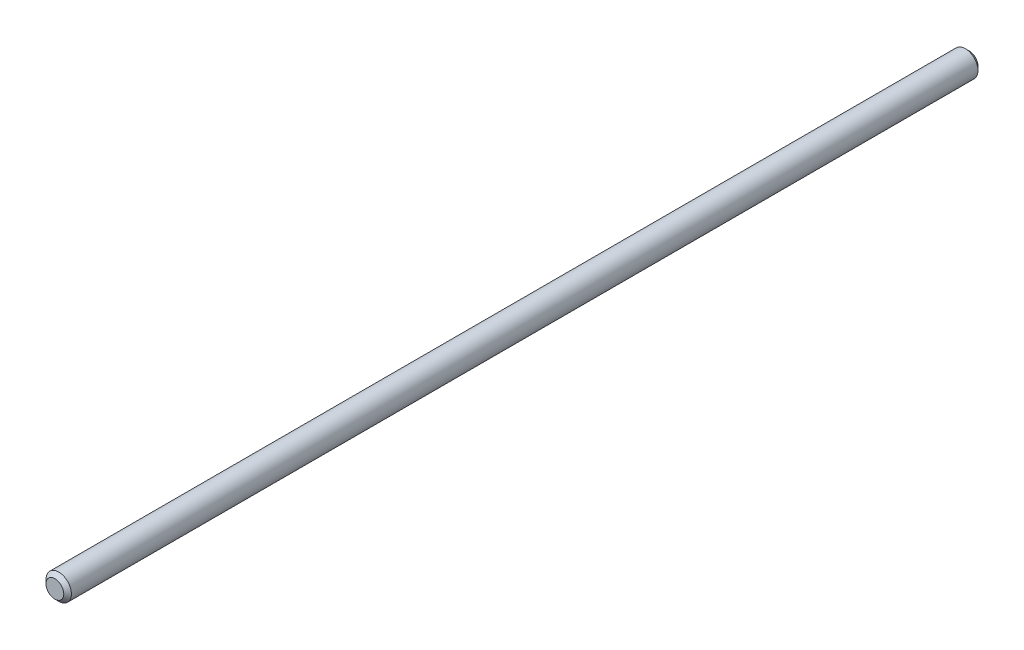
ISO-10303-21;
HEADER;
FILE_DESCRIPTION(('STEP AP214'),'2;1');
FILE_NAME('part.step','',(''),(''),'','','');
FILE_SCHEMA(('AUTOMOTIVE_DESIGN { 1 0 10303 214 1 1 1 1 }'));
ENDSEC;
DATA;
#1=APPLICATION_CONTEXT('core data for automotive mechanical design processes');
#2=APPLICATION_PROTOCOL_DEFINITION('international standard','automotive_design',2000,#1);
#3=PRODUCT_CONTEXT('',#1,'mechanical');
#4=PRODUCT('Part','Part','',(#3));
#5=PRODUCT_RELATED_PRODUCT_CATEGORY('part','',(#4));
#6=PRODUCT_DEFINITION_FORMATION('','',#4);
#7=PRODUCT_DEFINITION_CONTEXT('part definition',#1,'design');
#8=PRODUCT_DEFINITION('design','',#6,#7);
#9=PRODUCT_DEFINITION_SHAPE('','',#8);
#10=(LENGTH_UNIT() NAMED_UNIT(*) SI_UNIT(.MILLI.,.METRE.));
#11=(NAMED_UNIT(*) PLANE_ANGLE_UNIT() SI_UNIT($,.RADIAN.));
#12=(NAMED_UNIT(*) SI_UNIT($,.STERADIAN.) SOLID_ANGLE_UNIT());
#13=UNCERTAINTY_MEASURE_WITH_UNIT(LENGTH_MEASURE(1.E-05),#10,'distance_accuracy_value','');
#14=(GEOMETRIC_REPRESENTATION_CONTEXT(3) GLOBAL_UNCERTAINTY_ASSIGNED_CONTEXT((#13)) GLOBAL_UNIT_ASSIGNED_CONTEXT((#10,
#11,#12)) REPRESENTATION_CONTEXT('',''));
#15=CARTESIAN_POINT('',(0.,0.,0.));
#16=DIRECTION('',(0.,0.,1.));
#17=DIRECTION('',(1.,0.,0.));
#18=AXIS2_PLACEMENT_3D('',#15,#16,#17);
#19=CARTESIAN_POINT('',(0.,0.,114.3));
#20=DIRECTION('',(0.,0.,1.));
#21=DIRECTION('',(1.,0.,0.));
#22=AXIS2_PLACEMENT_3D('',#19,#20,#21);
#23=CYLINDRICAL_SURFACE('',#22,3.17500000000026);
#24=CARTESIAN_POINT('',(0.,0.,-113.3475));
#25=DIRECTION('',(0.,0.,1.));
#26=DIRECTION('',(1.,0.,0.));
#27=AXIS2_PLACEMENT_3D('',#24,#25,#26);
#28=CIRCLE('',#27,3.17500000000026);
#29=CARTESIAN_POINT('',(3.17500000000026,0.,-113.3475));
#30=VERTEX_POINT('',#29);
#31=EDGE_CURVE('E50',#30,#30,#28,.T.);
#32=ORIENTED_EDGE('',*,*,#31,.T.);
#33=EDGE_LOOP('',(#32));
#34=FACE_BOUND('',#33,.T.);
#35=CARTESIAN_POINT('',(0.,0.,113.3475));
#36=DIRECTION('',(0.,0.,-1.));
#37=DIRECTION('',(-1.,0.,0.));
#38=AXIS2_PLACEMENT_3D('',#35,#36,#37);
#39=CIRCLE('',#38,3.17500000000026);
#40=CARTESIAN_POINT('',(-3.17500000000026,0.,113.3475));
#41=VERTEX_POINT('',#40);
#42=EDGE_CURVE('E56',#41,#41,#39,.T.);
#43=ORIENTED_EDGE('',*,*,#42,.T.);
#44=EDGE_LOOP('',(#43));
#45=FACE_BOUND('',#44,.T.);
#46=ADVANCED_FACE('F36',(#34,#45),#23,.T.);
#47=CARTESIAN_POINT('',(0.,3.17500000000026,-114.3));
#48=DIRECTION('',(0.,0.,1.));
#49=DIRECTION('',(1.,0.,0.));
#50=AXIS2_PLACEMENT_3D('',#47,#48,#49);
#51=PLANE('',#50);
#52=CARTESIAN_POINT('',(0.,0.,-114.3));
#53=DIRECTION('',(0.,0.,1.));
#54=DIRECTION('',(1.,0.,0.));
#55=AXIS2_PLACEMENT_3D('',#52,#53,#54);
#56=CIRCLE('',#55,2.22250000000024);
#57=CARTESIAN_POINT('',(2.22250000000024,0.,-114.3));
#58=VERTEX_POINT('',#57);
#59=EDGE_CURVE('E44',#58,#58,#56,.F.);
#60=ORIENTED_EDGE('',*,*,#59,.T.);
#61=EDGE_LOOP('',(#60));
#62=FACE_BOUND('',#61,.T.);
#63=ADVANCED_FACE('F74',(#62),#51,.F.);
#64=CARTESIAN_POINT('',(0.,0.,114.3));
#65=DIRECTION('',(0.,0.,-1.));
#66=DIRECTION('',(-1.,0.,0.));
#67=AXIS2_PLACEMENT_3D('',#64,#65,#66);
#68=PLANE('',#67);
#69=CARTESIAN_POINT('',(0.,0.,114.3));
#70=DIRECTION('',(0.,0.,-1.));
#71=DIRECTION('',(-1.,0.,0.));
#72=AXIS2_PLACEMENT_3D('',#69,#70,#71);
#73=CIRCLE('',#72,2.22250000000027);
#74=CARTESIAN_POINT('',(-2.22250000000027,0.,114.3));
#75=VERTEX_POINT('',#74);
#76=EDGE_CURVE('E10',#75,#75,#73,.F.);
#77=ORIENTED_EDGE('',*,*,#76,.T.);
#78=EDGE_LOOP('',(#77));
#79=FACE_BOUND('',#78,.T.);
#80=ADVANCED_FACE('F71',(#79),#68,.F.);
#81=CARTESIAN_POINT('',(0.,0.,-113.3475));
#82=DIRECTION('',(0.,0.,1.));
#83=DIRECTION('',(1.,0.,0.));
#84=AXIS2_PLACEMENT_3D('',#81,#82,#83);
#85=CONICAL_SURFACE('',#84,3.17500000000026,0.785398163397434);
#86=ORIENTED_EDGE('',*,*,#59,.F.);
#87=EDGE_LOOP('',(#86));
#88=FACE_BOUND('',#87,.T.);
#89=ORIENTED_EDGE('',*,*,#31,.F.);
#90=EDGE_LOOP('',(#89));
#91=FACE_BOUND('',#90,.T.);
#92=ADVANCED_FACE('F67',(#88,#91),#85,.T.);
#93=CARTESIAN_POINT('',(0.,0.,114.3));
#94=DIRECTION('',(0.,0.,-1.));
#95=DIRECTION('',(-1.,0.,0.));
#96=AXIS2_PLACEMENT_3D('',#93,#94,#95);
#97=CONICAL_SURFACE('',#96,2.22250000000027,0.785398163397442);
#98=ORIENTED_EDGE('',*,*,#42,.F.);
#99=EDGE_LOOP('',(#98));
#100=FACE_BOUND('',#99,.T.);
#101=ORIENTED_EDGE('',*,*,#76,.F.);
#102=EDGE_LOOP('',(#101));
#103=FACE_BOUND('',#102,.T.);
#104=ADVANCED_FACE('F38',(#100,#103),#97,.T.);
#105=CLOSED_SHELL('',(#46,#63,#80,#92,#104));
#106=MANIFOLD_SOLID_BREP('B2',#105);
#107=ADVANCED_BREP_SHAPE_REPRESENTATION('',(#18,#106),#14);
#108=SHAPE_DEFINITION_REPRESENTATION(#9,#107);
ENDSEC;
END-ISO-10303-21;
